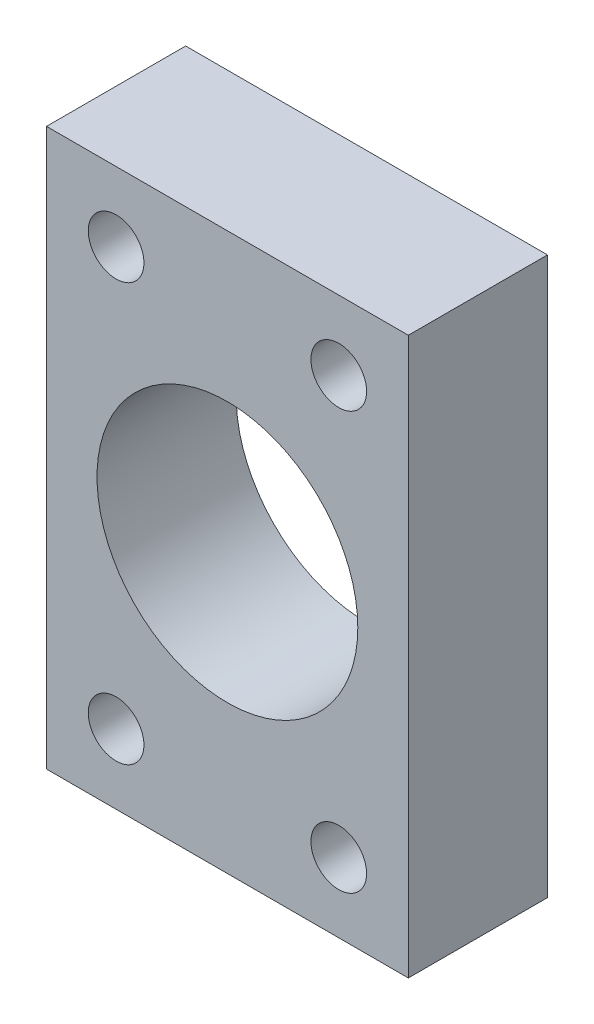
ISO-10303-21;
HEADER;
FILE_DESCRIPTION(('STEP AP214'),'2;1');
FILE_NAME('part.step','',(''),(''),'','','');
FILE_SCHEMA(('AUTOMOTIVE_DESIGN { 1 0 10303 214 1 1 1 1 }'));
ENDSEC;
DATA;
#1=APPLICATION_CONTEXT('core data for automotive mechanical design processes');
#2=APPLICATION_PROTOCOL_DEFINITION('international standard','automotive_design',2000,#1);
#3=PRODUCT_CONTEXT('',#1,'mechanical');
#4=PRODUCT('Part','Part','',(#3));
#5=PRODUCT_RELATED_PRODUCT_CATEGORY('part','',(#4));
#6=PRODUCT_DEFINITION_FORMATION('','',#4);
#7=PRODUCT_DEFINITION_CONTEXT('part definition',#1,'design');
#8=PRODUCT_DEFINITION('design','',#6,#7);
#9=PRODUCT_DEFINITION_SHAPE('','',#8);
#10=(LENGTH_UNIT() NAMED_UNIT(*) SI_UNIT(.MILLI.,.METRE.));
#11=(NAMED_UNIT(*) PLANE_ANGLE_UNIT() SI_UNIT($,.RADIAN.));
#12=(NAMED_UNIT(*) SI_UNIT($,.STERADIAN.) SOLID_ANGLE_UNIT());
#13=UNCERTAINTY_MEASURE_WITH_UNIT(LENGTH_MEASURE(1.E-05),#10,'distance_accuracy_value','');
#14=(GEOMETRIC_REPRESENTATION_CONTEXT(3) GLOBAL_UNCERTAINTY_ASSIGNED_CONTEXT((#13)) GLOBAL_UNIT_ASSIGNED_CONTEXT((#10,
#11,#12)) REPRESENTATION_CONTEXT('',''));
#15=CARTESIAN_POINT('',(0.,0.,0.));
#16=DIRECTION('',(0.,0.,1.));
#17=DIRECTION('',(1.,0.,0.));
#18=AXIS2_PLACEMENT_3D('',#15,#16,#17);
#19=CARTESIAN_POINT('',(0.,0.,12.7));
#20=DIRECTION('',(0.,0.,1.));
#21=DIRECTION('',(1.,0.,0.));
#22=AXIS2_PLACEMENT_3D('',#19,#20,#21);
#23=PLANE('',#22);
#24=CARTESIAN_POINT('',(-10.16,-19.05,12.7));
#25=DIRECTION('',(0.,0.,1.));
#26=DIRECTION('',(1.,0.,0.));
#27=AXIS2_PLACEMENT_3D('',#24,#25,#26);
#28=CIRCLE('',#27,2.54);
#29=CARTESIAN_POINT('',(-7.62,-19.05,12.7));
#30=VERTEX_POINT('',#29);
#31=EDGE_CURVE('E128',#30,#30,#28,.T.);
#32=ORIENTED_EDGE('',*,*,#31,.F.);
#33=EDGE_LOOP('',(#32));
#34=FACE_BOUND('',#33,.T.);
#35=CARTESIAN_POINT('',(10.16,19.05,12.7));
#36=DIRECTION('',(0.,0.,1.));
#37=DIRECTION('',(1.,0.,0.));
#38=AXIS2_PLACEMENT_3D('',#35,#36,#37);
#39=CIRCLE('',#38,2.54);
#40=CARTESIAN_POINT('',(12.7,19.05,12.7));
#41=VERTEX_POINT('',#40);
#42=EDGE_CURVE('E116',#41,#41,#39,.T.);
#43=ORIENTED_EDGE('',*,*,#42,.F.);
#44=EDGE_LOOP('',(#43));
#45=FACE_BOUND('',#44,.T.);
#46=DIRECTION('',(0.,1.,0.));
#47=VECTOR('',#46,1.);
#48=CARTESIAN_POINT('',(16.51,25.4,12.7));
#49=LINE('',#48,#47);
#50=CARTESIAN_POINT('',(16.51,-25.4,12.7));
#51=VERTEX_POINT('',#50);
#52=CARTESIAN_POINT('',(16.51,25.4,12.7));
#53=VERTEX_POINT('',#52);
#54=EDGE_CURVE('E86',#51,#53,#49,.T.);
#55=ORIENTED_EDGE('',*,*,#54,.T.);
#56=DIRECTION('',(-1.,0.,0.));
#57=VECTOR('',#56,1.);
#58=CARTESIAN_POINT('',(-16.51,25.4,12.7));
#59=LINE('',#58,#57);
#60=CARTESIAN_POINT('',(-16.51,25.4,12.7));
#61=VERTEX_POINT('',#60);
#62=EDGE_CURVE('E81',#53,#61,#59,.T.);
#63=ORIENTED_EDGE('',*,*,#62,.T.);
#64=DIRECTION('',(0.,-1.,0.));
#65=VECTOR('',#64,1.);
#66=CARTESIAN_POINT('',(-16.51,25.4,12.7));
#67=LINE('',#66,#65);
#68=CARTESIAN_POINT('',(-16.51,-25.4,12.7));
#69=VERTEX_POINT('',#68);
#70=EDGE_CURVE('E84',#61,#69,#67,.T.);
#71=ORIENTED_EDGE('',*,*,#70,.T.);
#72=DIRECTION('',(1.,0.,0.));
#73=VECTOR('',#72,1.);
#74=CARTESIAN_POINT('',(-16.51,-25.4,12.7));
#75=LINE('',#74,#73);
#76=EDGE_CURVE('E51',#69,#51,#75,.T.);
#77=ORIENTED_EDGE('',*,*,#76,.T.);
#78=EDGE_LOOP('',(#55,#63,#71,#77));
#79=FACE_BOUND('',#78,.T.);
#80=CARTESIAN_POINT('',(-10.16,19.05,12.7));
#81=DIRECTION('',(0.,0.,1.));
#82=DIRECTION('',(1.,0.,0.));
#83=AXIS2_PLACEMENT_3D('',#80,#81,#82);
#84=CIRCLE('',#83,2.54);
#85=CARTESIAN_POINT('',(-7.62,19.05,12.7));
#86=VERTEX_POINT('',#85);
#87=EDGE_CURVE('E101',#86,#86,#84,.T.);
#88=ORIENTED_EDGE('',*,*,#87,.F.);
#89=EDGE_LOOP('',(#88));
#90=FACE_BOUND('',#89,.T.);
#91=CARTESIAN_POINT('',(10.16,-19.05,12.7));
#92=DIRECTION('',(0.,0.,1.));
#93=DIRECTION('',(1.,0.,0.));
#94=AXIS2_PLACEMENT_3D('',#91,#92,#93);
#95=CIRCLE('',#94,2.54000000000001);
#96=CARTESIAN_POINT('',(12.7,-19.05,12.7));
#97=VERTEX_POINT('',#96);
#98=EDGE_CURVE('E122',#97,#97,#95,.T.);
#99=ORIENTED_EDGE('',*,*,#98,.F.);
#100=EDGE_LOOP('',(#99));
#101=FACE_BOUND('',#100,.T.);
#102=CARTESIAN_POINT('',(0.,0.,12.7));
#103=DIRECTION('',(0.,0.,1.));
#104=DIRECTION('',(1.,0.,0.));
#105=AXIS2_PLACEMENT_3D('',#102,#103,#104);
#106=CIRCLE('',#105,11.8999);
#107=CARTESIAN_POINT('',(11.8999,0.,12.7));
#108=VERTEX_POINT('',#107);
#109=EDGE_CURVE('E134',#108,#108,#106,.T.);
#110=ORIENTED_EDGE('',*,*,#109,.F.);
#111=EDGE_LOOP('',(#110));
#112=FACE_BOUND('',#111,.T.);
#113=ADVANCED_FACE('F34',(#34,#45,#79,#90,#101,#112),#23,.T.);
#114=CARTESIAN_POINT('',(0.,0.,0.));
#115=DIRECTION('',(0.,0.,1.));
#116=DIRECTION('',(1.,0.,0.));
#117=AXIS2_PLACEMENT_3D('',#114,#115,#116);
#118=PLANE('',#117);
#119=CARTESIAN_POINT('',(-10.16,-19.05,0.));
#120=DIRECTION('',(0.,0.,1.));
#121=DIRECTION('',(1.,0.,0.));
#122=AXIS2_PLACEMENT_3D('',#119,#120,#121);
#123=CIRCLE('',#122,2.54);
#124=CARTESIAN_POINT('',(-7.62,-19.05,0.));
#125=VERTEX_POINT('',#124);
#126=EDGE_CURVE('E131',#125,#125,#123,.T.);
#127=ORIENTED_EDGE('',*,*,#126,.T.);
#128=EDGE_LOOP('',(#127));
#129=FACE_BOUND('',#128,.T.);
#130=CARTESIAN_POINT('',(10.16,19.05,0.));
#131=DIRECTION('',(0.,0.,1.));
#132=DIRECTION('',(1.,0.,0.));
#133=AXIS2_PLACEMENT_3D('',#130,#131,#132);
#134=CIRCLE('',#133,2.54);
#135=CARTESIAN_POINT('',(12.7,19.05,0.));
#136=VERTEX_POINT('',#135);
#137=EDGE_CURVE('E119',#136,#136,#134,.T.);
#138=ORIENTED_EDGE('',*,*,#137,.T.);
#139=EDGE_LOOP('',(#138));
#140=FACE_BOUND('',#139,.T.);
#141=DIRECTION('',(0.,1.,0.));
#142=VECTOR('',#141,1.);
#143=CARTESIAN_POINT('',(16.51,25.4,0.));
#144=LINE('',#143,#142);
#145=CARTESIAN_POINT('',(16.51,-25.4,0.));
#146=VERTEX_POINT('',#145);
#147=CARTESIAN_POINT('',(16.51,25.4,0.));
#148=VERTEX_POINT('',#147);
#149=EDGE_CURVE('E98',#146,#148,#144,.T.);
#150=ORIENTED_EDGE('',*,*,#149,.F.);
#151=DIRECTION('',(1.,0.,0.));
#152=VECTOR('',#151,1.);
#153=CARTESIAN_POINT('',(-16.51,-25.4,0.));
#154=LINE('',#153,#152);
#155=CARTESIAN_POINT('',(-16.51,-25.4,0.));
#156=VERTEX_POINT('',#155);
#157=EDGE_CURVE('E74',#156,#146,#154,.T.);
#158=ORIENTED_EDGE('',*,*,#157,.F.);
#159=DIRECTION('',(0.,-1.,0.));
#160=VECTOR('',#159,1.);
#161=CARTESIAN_POINT('',(-16.51,25.4,0.));
#162=LINE('',#161,#160);
#163=CARTESIAN_POINT('',(-16.51,25.4,0.));
#164=VERTEX_POINT('',#163);
#165=EDGE_CURVE('E68',#164,#156,#162,.T.);
#166=ORIENTED_EDGE('',*,*,#165,.F.);
#167=DIRECTION('',(-1.,0.,0.));
#168=VECTOR('',#167,1.);
#169=CARTESIAN_POINT('',(-16.51,25.4,0.));
#170=LINE('',#169,#168);
#171=EDGE_CURVE('E90',#148,#164,#170,.T.);
#172=ORIENTED_EDGE('',*,*,#171,.F.);
#173=EDGE_LOOP('',(#150,#158,#166,#172));
#174=FACE_BOUND('',#173,.T.);
#175=CARTESIAN_POINT('',(-10.16,19.05,0.));
#176=DIRECTION('',(0.,0.,1.));
#177=DIRECTION('',(1.,0.,0.));
#178=AXIS2_PLACEMENT_3D('',#175,#176,#177);
#179=CIRCLE('',#178,2.54);
#180=CARTESIAN_POINT('',(-7.62,19.05,0.));
#181=VERTEX_POINT('',#180);
#182=EDGE_CURVE('E113',#181,#181,#179,.T.);
#183=ORIENTED_EDGE('',*,*,#182,.T.);
#184=EDGE_LOOP('',(#183));
#185=FACE_BOUND('',#184,.T.);
#186=CARTESIAN_POINT('',(10.16,-19.05,0.));
#187=DIRECTION('',(0.,0.,1.));
#188=DIRECTION('',(1.,0.,0.));
#189=AXIS2_PLACEMENT_3D('',#186,#187,#188);
#190=CIRCLE('',#189,2.54000000000001);
#191=CARTESIAN_POINT('',(12.7,-19.05,0.));
#192=VERTEX_POINT('',#191);
#193=EDGE_CURVE('E125',#192,#192,#190,.T.);
#194=ORIENTED_EDGE('',*,*,#193,.T.);
#195=EDGE_LOOP('',(#194));
#196=FACE_BOUND('',#195,.T.);
#197=CARTESIAN_POINT('',(0.,0.,0.));
#198=DIRECTION('',(0.,0.,1.));
#199=DIRECTION('',(1.,0.,0.));
#200=AXIS2_PLACEMENT_3D('',#197,#198,#199);
#201=CIRCLE('',#200,11.8999);
#202=CARTESIAN_POINT('',(11.8999,0.,0.));
#203=VERTEX_POINT('',#202);
#204=EDGE_CURVE('E137',#203,#203,#201,.T.);
#205=ORIENTED_EDGE('',*,*,#204,.T.);
#206=EDGE_LOOP('',(#205));
#207=FACE_BOUND('',#206,.T.);
#208=ADVANCED_FACE('F109',(#129,#140,#174,#185,#196,#207),#118,.F.);
#209=CARTESIAN_POINT('',(16.51,25.4,12.7));
#210=DIRECTION('',(-1.,0.,0.));
#211=DIRECTION('',(0.,0.,1.));
#212=AXIS2_PLACEMENT_3D('',#209,#210,#211);
#213=PLANE('',#212);
#214=ORIENTED_EDGE('',*,*,#149,.T.);
#215=DIRECTION('',(0.,0.,-1.));
#216=VECTOR('',#215,1.);
#217=CARTESIAN_POINT('',(16.51,25.4,12.7));
#218=LINE('',#217,#216);
#219=EDGE_CURVE('E11',#53,#148,#218,.T.);
#220=ORIENTED_EDGE('',*,*,#219,.F.);
#221=ORIENTED_EDGE('',*,*,#54,.F.);
#222=DIRECTION('',(0.,0.,-1.));
#223=VECTOR('',#222,1.);
#224=CARTESIAN_POINT('',(16.51,-25.4,12.7));
#225=LINE('',#224,#223);
#226=EDGE_CURVE('E94',#51,#146,#225,.T.);
#227=ORIENTED_EDGE('',*,*,#226,.T.);
#228=EDGE_LOOP('',(#214,#220,#221,#227));
#229=FACE_BOUND('',#228,.T.);
#230=ADVANCED_FACE('F36',(#229),#213,.F.);
#231=CARTESIAN_POINT('',(-16.51,25.4,12.7));
#232=DIRECTION('',(0.,-1.,0.));
#233=DIRECTION('',(0.,0.,-1.));
#234=AXIS2_PLACEMENT_3D('',#231,#232,#233);
#235=PLANE('',#234);
#236=ORIENTED_EDGE('',*,*,#171,.T.);
#237=DIRECTION('',(0.,0.,-1.));
#238=VECTOR('',#237,1.);
#239=CARTESIAN_POINT('',(-16.51,25.4,12.7));
#240=LINE('',#239,#238);
#241=EDGE_CURVE('E43',#61,#164,#240,.T.);
#242=ORIENTED_EDGE('',*,*,#241,.F.);
#243=ORIENTED_EDGE('',*,*,#62,.F.);
#244=ORIENTED_EDGE('',*,*,#219,.T.);
#245=EDGE_LOOP('',(#236,#242,#243,#244));
#246=FACE_BOUND('',#245,.T.);
#247=ADVANCED_FACE('F89',(#246),#235,.F.);
#248=CARTESIAN_POINT('',(-16.51,25.4,12.7));
#249=DIRECTION('',(1.,0.,0.));
#250=DIRECTION('',(0.,0.,-1.));
#251=AXIS2_PLACEMENT_3D('',#248,#249,#250);
#252=PLANE('',#251);
#253=ORIENTED_EDGE('',*,*,#165,.T.);
#254=DIRECTION('',(0.,0.,-1.));
#255=VECTOR('',#254,1.);
#256=CARTESIAN_POINT('',(-16.51,-25.4,12.7));
#257=LINE('',#256,#255);
#258=EDGE_CURVE('E91',#69,#156,#257,.T.);
#259=ORIENTED_EDGE('',*,*,#258,.F.);
#260=ORIENTED_EDGE('',*,*,#70,.F.);
#261=ORIENTED_EDGE('',*,*,#241,.T.);
#262=EDGE_LOOP('',(#253,#259,#260,#261));
#263=FACE_BOUND('',#262,.T.);
#264=ADVANCED_FACE('F92',(#263),#252,.F.);
#265=CARTESIAN_POINT('',(-16.51,-25.4,12.7));
#266=DIRECTION('',(0.,1.,0.));
#267=DIRECTION('',(0.,0.,1.));
#268=AXIS2_PLACEMENT_3D('',#265,#266,#267);
#269=PLANE('',#268);
#270=ORIENTED_EDGE('',*,*,#157,.T.);
#271=ORIENTED_EDGE('',*,*,#226,.F.);
#272=ORIENTED_EDGE('',*,*,#76,.F.);
#273=ORIENTED_EDGE('',*,*,#258,.T.);
#274=EDGE_LOOP('',(#270,#271,#272,#273));
#275=FACE_BOUND('',#274,.T.);
#276=ADVANCED_FACE('F106',(#275),#269,.F.);
#277=CARTESIAN_POINT('',(-10.16,19.05,12.7));
#278=DIRECTION('',(0.,0.,-1.));
#279=DIRECTION('',(-1.,0.,0.));
#280=AXIS2_PLACEMENT_3D('',#277,#278,#279);
#281=CYLINDRICAL_SURFACE('',#280,2.54);
#282=ORIENTED_EDGE('',*,*,#87,.T.);
#283=EDGE_LOOP('',(#282));
#284=FACE_BOUND('',#283,.T.);
#285=ORIENTED_EDGE('',*,*,#182,.F.);
#286=EDGE_LOOP('',(#285));
#287=FACE_BOUND('',#286,.T.);
#288=ADVANCED_FACE('F157',(#284,#287),#281,.F.);
#289=CARTESIAN_POINT('',(10.16,19.05,12.7));
#290=DIRECTION('',(0.,0.,-1.));
#291=DIRECTION('',(-1.,0.,0.));
#292=AXIS2_PLACEMENT_3D('',#289,#290,#291);
#293=CYLINDRICAL_SURFACE('',#292,2.54);
#294=ORIENTED_EDGE('',*,*,#42,.T.);
#295=EDGE_LOOP('',(#294));
#296=FACE_BOUND('',#295,.T.);
#297=ORIENTED_EDGE('',*,*,#137,.F.);
#298=EDGE_LOOP('',(#297));
#299=FACE_BOUND('',#298,.T.);
#300=ADVANCED_FACE('F203',(#296,#299),#293,.F.);
#301=CARTESIAN_POINT('',(10.16,-19.05,12.7));
#302=DIRECTION('',(0.,0.,-1.));
#303=DIRECTION('',(-1.,0.,0.));
#304=AXIS2_PLACEMENT_3D('',#301,#302,#303);
#305=CYLINDRICAL_SURFACE('',#304,2.54000000000001);
#306=ORIENTED_EDGE('',*,*,#98,.T.);
#307=EDGE_LOOP('',(#306));
#308=FACE_BOUND('',#307,.T.);
#309=ORIENTED_EDGE('',*,*,#193,.F.);
#310=EDGE_LOOP('',(#309));
#311=FACE_BOUND('',#310,.T.);
#312=ADVANCED_FACE('F211',(#308,#311),#305,.F.);
#313=CARTESIAN_POINT('',(-10.16,-19.05,12.7));
#314=DIRECTION('',(0.,0.,-1.));
#315=DIRECTION('',(-1.,0.,0.));
#316=AXIS2_PLACEMENT_3D('',#313,#314,#315);
#317=CYLINDRICAL_SURFACE('',#316,2.54);
#318=ORIENTED_EDGE('',*,*,#31,.T.);
#319=EDGE_LOOP('',(#318));
#320=FACE_BOUND('',#319,.T.);
#321=ORIENTED_EDGE('',*,*,#126,.F.);
#322=EDGE_LOOP('',(#321));
#323=FACE_BOUND('',#322,.T.);
#324=ADVANCED_FACE('F219',(#320,#323),#317,.F.);
#325=CARTESIAN_POINT('',(0.,0.,12.7));
#326=DIRECTION('',(0.,0.,-1.));
#327=DIRECTION('',(-1.,0.,0.));
#328=AXIS2_PLACEMENT_3D('',#325,#326,#327);
#329=CYLINDRICAL_SURFACE('',#328,11.8999);
#330=ORIENTED_EDGE('',*,*,#109,.T.);
#331=EDGE_LOOP('',(#330));
#332=FACE_BOUND('',#331,.T.);
#333=ORIENTED_EDGE('',*,*,#204,.F.);
#334=EDGE_LOOP('',(#333));
#335=FACE_BOUND('',#334,.T.);
#336=ADVANCED_FACE('F143',(#332,#335),#329,.F.);
#337=CLOSED_SHELL('',(#113,#208,#230,#247,#264,#276,#288,#300,#312,#324,#336));
#338=MANIFOLD_SOLID_BREP('B2',#337);
#339=ADVANCED_BREP_SHAPE_REPRESENTATION('',(#18,#338),#14);
#340=SHAPE_DEFINITION_REPRESENTATION(#9,#339);
ENDSEC;
END-ISO-10303-21;
